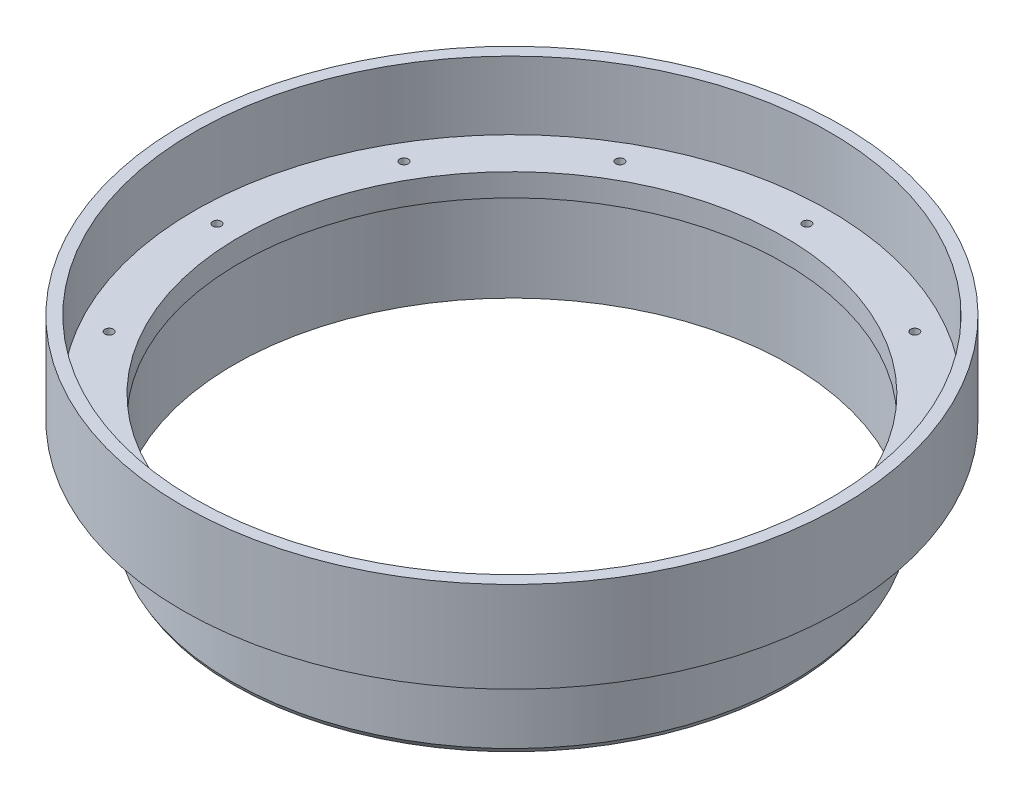
ISO-10303-21;
HEADER;
FILE_DESCRIPTION(('STEP AP214'),'2;1');
FILE_NAME('part.step','',(''),(''),'','','');
FILE_SCHEMA(('AUTOMOTIVE_DESIGN { 1 0 10303 214 1 1 1 1 }'));
ENDSEC;
DATA;
#1=APPLICATION_CONTEXT('core data for automotive mechanical design processes');
#2=APPLICATION_PROTOCOL_DEFINITION('international standard','automotive_design',2000,#1);
#3=PRODUCT_CONTEXT('',#1,'mechanical');
#4=PRODUCT('Part','Part','',(#3));
#5=PRODUCT_RELATED_PRODUCT_CATEGORY('part','',(#4));
#6=PRODUCT_DEFINITION_FORMATION('','',#4);
#7=PRODUCT_DEFINITION_CONTEXT('part definition',#1,'design');
#8=PRODUCT_DEFINITION('design','',#6,#7);
#9=PRODUCT_DEFINITION_SHAPE('','',#8);
#10=(LENGTH_UNIT() NAMED_UNIT(*) SI_UNIT(.MILLI.,.METRE.));
#11=(NAMED_UNIT(*) PLANE_ANGLE_UNIT() SI_UNIT($,.RADIAN.));
#12=(NAMED_UNIT(*) SI_UNIT($,.STERADIAN.) SOLID_ANGLE_UNIT());
#13=UNCERTAINTY_MEASURE_WITH_UNIT(LENGTH_MEASURE(1.E-05),#10,'distance_accuracy_value','');
#14=(GEOMETRIC_REPRESENTATION_CONTEXT(3) GLOBAL_UNCERTAINTY_ASSIGNED_CONTEXT((#13)) GLOBAL_UNIT_ASSIGNED_CONTEXT((#10,
#11,#12)) REPRESENTATION_CONTEXT('',''));
#15=CARTESIAN_POINT('',(0.,0.,0.));
#16=DIRECTION('',(0.,0.,1.));
#17=DIRECTION('',(1.,0.,0.));
#18=AXIS2_PLACEMENT_3D('',#15,#16,#17);
#19=CARTESIAN_POINT('',(-44.45,0.,0.));
#20=DIRECTION('',(0.,1.,0.));
#21=DIRECTION('',(0.,0.,1.));
#22=AXIS2_PLACEMENT_3D('',#19,#20,#21);
#23=PLANE('',#22);
#24=CARTESIAN_POINT('',(-35.7451985412029,0.,20.6374999999996));
#25=DIRECTION('',(0.,1.,0.));
#26=DIRECTION('',(0.,0.,1.));
#27=AXIS2_PLACEMENT_3D('',#24,#25,#26);
#28=CIRCLE('',#27,0.59563);
#29=CARTESIAN_POINT('',(-35.7451985412029,0.,21.2331299999996));
#30=VERTEX_POINT('',#29);
#31=EDGE_CURVE('E140',#30,#30,#28,.T.);
#32=ORIENTED_EDGE('',*,*,#31,.F.);
#33=EDGE_LOOP('',(#32));
#34=FACE_BOUND('',#33,.T.);
#35=CARTESIAN_POINT('',(-20.6375000000004,0.,35.7451985412025));
#36=DIRECTION('',(0.,1.,0.));
#37=DIRECTION('',(0.,0.,1.));
#38=AXIS2_PLACEMENT_3D('',#35,#36,#37);
#39=CIRCLE('',#38,0.59563);
#40=CARTESIAN_POINT('',(-20.6375000000004,0.,36.3408285412025));
#41=VERTEX_POINT('',#40);
#42=EDGE_CURVE('E134',#41,#41,#39,.T.);
#43=ORIENTED_EDGE('',*,*,#42,.F.);
#44=EDGE_LOOP('',(#43));
#45=FACE_BOUND('',#44,.T.);
#46=CARTESIAN_POINT('',(-3.53958818572525E-13,0.,41.275));
#47=DIRECTION('',(0.,1.,0.));
#48=DIRECTION('',(0.,0.,1.));
#49=AXIS2_PLACEMENT_3D('',#46,#47,#48);
#50=CIRCLE('',#49,0.595629999999999);
#51=CARTESIAN_POINT('',(-3.53958818572525E-13,0.,41.87063));
#52=VERTEX_POINT('',#51);
#53=EDGE_CURVE('E128',#52,#52,#50,.T.);
#54=ORIENTED_EDGE('',*,*,#53,.F.);
#55=EDGE_LOOP('',(#54));
#56=FACE_BOUND('',#55,.T.);
#57=CARTESIAN_POINT('',(20.6374999999997,0.,35.7451985412029));
#58=DIRECTION('',(0.,1.,0.));
#59=DIRECTION('',(0.,0.,1.));
#60=AXIS2_PLACEMENT_3D('',#57,#58,#59);
#61=CIRCLE('',#60,0.59563);
#62=CARTESIAN_POINT('',(20.6374999999997,0.,36.3408285412029));
#63=VERTEX_POINT('',#62);
#64=EDGE_CURVE('E122',#63,#63,#61,.T.);
#65=ORIENTED_EDGE('',*,*,#64,.F.);
#66=EDGE_LOOP('',(#65));
#67=FACE_BOUND('',#66,.T.);
#68=CARTESIAN_POINT('',(35.7451985412026,0.,20.6375000000002));
#69=DIRECTION('',(0.,1.,0.));
#70=DIRECTION('',(0.,0.,1.));
#71=AXIS2_PLACEMENT_3D('',#68,#69,#70);
#72=CIRCLE('',#71,0.59563);
#73=CARTESIAN_POINT('',(35.7451985412026,0.,21.2331300000002));
#74=VERTEX_POINT('',#73);
#75=EDGE_CURVE('E116',#74,#74,#72,.T.);
#76=ORIENTED_EDGE('',*,*,#75,.F.);
#77=EDGE_LOOP('',(#76));
#78=FACE_BOUND('',#77,.T.);
#79=CARTESIAN_POINT('',(41.275,0.,2.28177708448336E-13));
#80=DIRECTION('',(0.,1.,0.));
#81=DIRECTION('',(0.,0.,1.));
#82=AXIS2_PLACEMENT_3D('',#79,#80,#81);
#83=CIRCLE('',#82,0.59563);
#84=CARTESIAN_POINT('',(41.275,0.,0.595630000000228));
#85=VERTEX_POINT('',#84);
#86=EDGE_CURVE('E110',#85,#85,#83,.T.);
#87=ORIENTED_EDGE('',*,*,#86,.F.);
#88=EDGE_LOOP('',(#87));
#89=FACE_BOUND('',#88,.T.);
#90=CARTESIAN_POINT('',(35.7451985412028,0.,-20.6374999999998));
#91=DIRECTION('',(0.,1.,0.));
#92=DIRECTION('',(0.,0.,1.));
#93=AXIS2_PLACEMENT_3D('',#90,#91,#92);
#94=CIRCLE('',#93,0.59563);
#95=CARTESIAN_POINT('',(35.7451985412028,0.,-20.0418699999998));
#96=VERTEX_POINT('',#95);
#97=EDGE_CURVE('E104',#96,#96,#94,.T.);
#98=ORIENTED_EDGE('',*,*,#97,.F.);
#99=EDGE_LOOP('',(#98));
#100=FACE_BOUND('',#99,.T.);
#101=CARTESIAN_POINT('',(20.6375000000001,0.,-35.7451985412026));
#102=DIRECTION('',(0.,1.,0.));
#103=DIRECTION('',(0.,0.,1.));
#104=AXIS2_PLACEMENT_3D('',#101,#102,#103);
#105=CIRCLE('',#104,0.59563);
#106=CARTESIAN_POINT('',(20.6375000000001,0.,-35.1495685412026));
#107=VERTEX_POINT('',#106);
#108=EDGE_CURVE('E98',#107,#107,#105,.T.);
#109=ORIENTED_EDGE('',*,*,#108,.F.);
#110=EDGE_LOOP('',(#109));
#111=FACE_BOUND('',#110,.T.);
#112=CARTESIAN_POINT('',(1.11561489392428E-13,0.,-41.275));
#113=DIRECTION('',(0.,1.,0.));
#114=DIRECTION('',(0.,0.,1.));
#115=AXIS2_PLACEMENT_3D('',#112,#113,#114);
#116=CIRCLE('',#115,0.595629999999999);
#117=CARTESIAN_POINT('',(1.11561489392428E-13,0.,-40.67937));
#118=VERTEX_POINT('',#117);
#119=EDGE_CURVE('E92',#118,#118,#116,.T.);
#120=ORIENTED_EDGE('',*,*,#119,.F.);
#121=EDGE_LOOP('',(#120));
#122=FACE_BOUND('',#121,.T.);
#123=CARTESIAN_POINT('',(-20.6374999999999,0.,-35.7451985412027));
#124=DIRECTION('',(0.,1.,0.));
#125=DIRECTION('',(0.,0.,1.));
#126=AXIS2_PLACEMENT_3D('',#123,#124,#125);
#127=CIRCLE('',#126,0.59563);
#128=CARTESIAN_POINT('',(-20.6374999999999,0.,-35.1495685412027));
#129=VERTEX_POINT('',#128);
#130=EDGE_CURVE('E86',#129,#129,#127,.T.);
#131=ORIENTED_EDGE('',*,*,#130,.F.);
#132=EDGE_LOOP('',(#131));
#133=FACE_BOUND('',#132,.T.);
#134=CARTESIAN_POINT('',(-35.7451985412027,0.,-20.6375));
#135=DIRECTION('',(0.,1.,0.));
#136=DIRECTION('',(0.,0.,1.));
#137=AXIS2_PLACEMENT_3D('',#134,#135,#136);
#138=CIRCLE('',#137,0.59563);
#139=CARTESIAN_POINT('',(-35.7451985412027,0.,-20.04187));
#140=VERTEX_POINT('',#139);
#141=EDGE_CURVE('E80',#140,#140,#138,.T.);
#142=ORIENTED_EDGE('',*,*,#141,.F.);
#143=EDGE_LOOP('',(#142));
#144=FACE_BOUND('',#143,.T.);
#145=CARTESIAN_POINT('',(-41.275,0.,0.));
#146=DIRECTION('',(0.,1.,0.));
#147=DIRECTION('',(0.,0.,1.));
#148=AXIS2_PLACEMENT_3D('',#145,#146,#147);
#149=CIRCLE('',#148,0.59563);
#150=CARTESIAN_POINT('',(-41.275,0.,0.595630000000005));
#151=VERTEX_POINT('',#150);
#152=EDGE_CURVE('E74',#151,#151,#149,.T.);
#153=ORIENTED_EDGE('',*,*,#152,.F.);
#154=EDGE_LOOP('',(#153));
#155=FACE_BOUND('',#154,.T.);
#156=CARTESIAN_POINT('',(0.,0.,0.));
#157=DIRECTION('',(0.,1.,0.));
#158=DIRECTION('',(0.,0.,1.));
#159=AXIS2_PLACEMENT_3D('',#156,#157,#158);
#160=CIRCLE('',#159,44.45);
#161=CARTESIAN_POINT('',(0.,0.,44.45));
#162=VERTEX_POINT('',#161);
#163=EDGE_CURVE('E68',#162,#162,#160,.T.);
#164=ORIENTED_EDGE('',*,*,#163,.T.);
#165=EDGE_LOOP('',(#164));
#166=FACE_BOUND('',#165,.T.);
#167=CARTESIAN_POINT('',(0.,0.,0.));
#168=DIRECTION('',(0.,1.,0.));
#169=DIRECTION('',(0.,0.,1.));
#170=AXIS2_PLACEMENT_3D('',#167,#168,#169);
#171=CIRCLE('',#170,38.1);
#172=CARTESIAN_POINT('',(0.,0.,38.1));
#173=VERTEX_POINT('',#172);
#174=EDGE_CURVE('E10',#173,#173,#171,.T.);
#175=ORIENTED_EDGE('',*,*,#174,.F.);
#176=EDGE_LOOP('',(#175));
#177=FACE_BOUND('',#176,.T.);
#178=ADVANCED_FACE('F34',(#34,#45,#56,#67,#78,#89,#100,#111,#122,#133,#144,#155,#166,#177),#23,.T.);
#179=CARTESIAN_POINT('',(0.,55.,0.));
#180=DIRECTION('',(0.,1.,0.));
#181=DIRECTION('',(0.,0.,1.));
#182=AXIS2_PLACEMENT_3D('',#179,#180,#181);
#183=CYLINDRICAL_SURFACE('',#182,38.1);
#184=ORIENTED_EDGE('',*,*,#174,.T.);
#185=EDGE_LOOP('',(#184));
#186=FACE_BOUND('',#185,.T.);
#187=CARTESIAN_POINT('',(0.,-3.175,0.));
#188=DIRECTION('',(0.,1.,0.));
#189=DIRECTION('',(0.,0.,1.));
#190=AXIS2_PLACEMENT_3D('',#187,#188,#189);
#191=CIRCLE('',#190,38.1);
#192=CARTESIAN_POINT('',(0.,-3.175,38.1));
#193=VERTEX_POINT('',#192);
#194=EDGE_CURVE('E40',#193,#193,#191,.T.);
#195=ORIENTED_EDGE('',*,*,#194,.F.);
#196=EDGE_LOOP('',(#195));
#197=FACE_BOUND('',#196,.T.);
#198=ADVANCED_FACE('F148',(#186,#197),#183,.F.);
#199=CARTESIAN_POINT('',(-38.1,-3.175,0.));
#200=DIRECTION('',(0.,-1.,0.));
#201=DIRECTION('',(0.,0.,-1.));
#202=AXIS2_PLACEMENT_3D('',#199,#200,#201);
#203=PLANE('',#202);
#204=ORIENTED_EDGE('',*,*,#194,.T.);
#205=EDGE_LOOP('',(#204));
#206=FACE_BOUND('',#205,.T.);
#207=CARTESIAN_POINT('',(0.,-3.175,0.));
#208=DIRECTION('',(0.,1.,0.));
#209=DIRECTION('',(0.,0.,1.));
#210=AXIS2_PLACEMENT_3D('',#207,#208,#209);
#211=CIRCLE('',#210,38.8874);
#212=CARTESIAN_POINT('',(0.,-3.175,38.8874));
#213=VERTEX_POINT('',#212);
#214=EDGE_CURVE('E44',#213,#213,#211,.T.);
#215=ORIENTED_EDGE('',*,*,#214,.F.);
#216=EDGE_LOOP('',(#215));
#217=FACE_BOUND('',#216,.T.);
#218=ADVANCED_FACE('F210',(#206,#217),#203,.T.);
#219=CARTESIAN_POINT('',(0.,55.,0.));
#220=DIRECTION('',(0.,1.,0.));
#221=DIRECTION('',(0.,0.,1.));
#222=AXIS2_PLACEMENT_3D('',#219,#220,#221);
#223=CYLINDRICAL_SURFACE('',#222,38.8874);
#224=ORIENTED_EDGE('',*,*,#214,.T.);
#225=EDGE_LOOP('',(#224));
#226=FACE_BOUND('',#225,.T.);
#227=CARTESIAN_POINT('',(0.,-15.875,0.));
#228=DIRECTION('',(0.,1.,0.));
#229=DIRECTION('',(0.,0.,1.));
#230=AXIS2_PLACEMENT_3D('',#227,#228,#229);
#231=CIRCLE('',#230,38.8874);
#232=CARTESIAN_POINT('',(0.,-15.875,38.8874));
#233=VERTEX_POINT('',#232);
#234=EDGE_CURVE('E48',#233,#233,#231,.T.);
#235=ORIENTED_EDGE('',*,*,#234,.F.);
#236=EDGE_LOOP('',(#235));
#237=FACE_BOUND('',#236,.T.);
#238=ADVANCED_FACE('F206',(#226,#237),#223,.F.);
#239=CARTESIAN_POINT('',(0.,-15.2150886423163,0.));
#240=DIRECTION('',(0.,1.,0.));
#241=DIRECTION('',(0.,0.,1.));
#242=AXIS2_PLACEMENT_3D('',#239,#240,#241);
#243=CONICAL_SURFACE('',#242,39.2684,0.523598775598298);
#244=ORIENTED_EDGE('',*,*,#234,.T.);
#245=EDGE_LOOP('',(#244));
#246=FACE_BOUND('',#245,.T.);
#247=CARTESIAN_POINT('',(0.,-15.2150886423163,0.));
#248=DIRECTION('',(0.,1.,0.));
#249=DIRECTION('',(0.,0.,1.));
#250=AXIS2_PLACEMENT_3D('',#247,#248,#249);
#251=CIRCLE('',#250,39.2684);
#252=CARTESIAN_POINT('',(0.,-15.2150886423163,39.2684));
#253=VERTEX_POINT('',#252);
#254=EDGE_CURVE('E53',#253,#253,#251,.T.);
#255=ORIENTED_EDGE('',*,*,#254,.F.);
#256=EDGE_LOOP('',(#255));
#257=FACE_BOUND('',#256,.T.);
#258=ADVANCED_FACE('F202',(#246,#257),#243,.T.);
#259=CARTESIAN_POINT('',(0.,55.,0.));
#260=DIRECTION('',(0.,1.,0.));
#261=DIRECTION('',(0.,0.,1.));
#262=AXIS2_PLACEMENT_3D('',#259,#260,#261);
#263=CYLINDRICAL_SURFACE('',#262,39.2684);
#264=ORIENTED_EDGE('',*,*,#254,.T.);
#265=EDGE_LOOP('',(#264));
#266=FACE_BOUND('',#265,.T.);
#267=CARTESIAN_POINT('',(0.,-3.175,0.));
#268=DIRECTION('',(0.,1.,0.));
#269=DIRECTION('',(0.,0.,1.));
#270=AXIS2_PLACEMENT_3D('',#267,#268,#269);
#271=CIRCLE('',#270,39.2684);
#272=CARTESIAN_POINT('',(0.,-3.175,39.2684));
#273=VERTEX_POINT('',#272);
#274=EDGE_CURVE('E56',#273,#273,#271,.T.);
#275=ORIENTED_EDGE('',*,*,#274,.F.);
#276=EDGE_LOOP('',(#275));
#277=FACE_BOUND('',#276,.T.);
#278=ADVANCED_FACE('F198',(#266,#277),#263,.T.);
#279=CARTESIAN_POINT('',(-39.2684,-3.175,0.));
#280=DIRECTION('',(0.,-1.,0.));
#281=DIRECTION('',(0.,0.,-1.));
#282=AXIS2_PLACEMENT_3D('',#279,#280,#281);
#283=PLANE('',#282);
#284=CARTESIAN_POINT('',(-35.7451985412029,-3.175,20.6374999999996));
#285=DIRECTION('',(0.,1.,0.));
#286=DIRECTION('',(0.,0.,1.));
#287=AXIS2_PLACEMENT_3D('',#284,#285,#286);
#288=CIRCLE('',#287,0.59563);
#289=CARTESIAN_POINT('',(-35.7451985412029,-3.175,21.2331299999996));
#290=VERTEX_POINT('',#289);
#291=EDGE_CURVE('E137',#290,#290,#288,.T.);
#292=ORIENTED_EDGE('',*,*,#291,.T.);
#293=EDGE_LOOP('',(#292));
#294=FACE_BOUND('',#293,.T.);
#295=CARTESIAN_POINT('',(-20.6375000000004,-3.175,35.7451985412025));
#296=DIRECTION('',(0.,1.,0.));
#297=DIRECTION('',(0.,0.,1.));
#298=AXIS2_PLACEMENT_3D('',#295,#296,#297);
#299=CIRCLE('',#298,0.59563);
#300=CARTESIAN_POINT('',(-20.6375000000004,-3.175,36.3408285412025));
#301=VERTEX_POINT('',#300);
#302=EDGE_CURVE('E131',#301,#301,#299,.T.);
#303=ORIENTED_EDGE('',*,*,#302,.T.);
#304=EDGE_LOOP('',(#303));
#305=FACE_BOUND('',#304,.T.);
#306=CARTESIAN_POINT('',(-3.53958818572525E-13,-3.175,41.275));
#307=DIRECTION('',(0.,1.,0.));
#308=DIRECTION('',(0.,0.,1.));
#309=AXIS2_PLACEMENT_3D('',#306,#307,#308);
#310=CIRCLE('',#309,0.595629999999999);
#311=CARTESIAN_POINT('',(-3.53958818572525E-13,-3.175,41.87063));
#312=VERTEX_POINT('',#311);
#313=EDGE_CURVE('E125',#312,#312,#310,.T.);
#314=ORIENTED_EDGE('',*,*,#313,.T.);
#315=EDGE_LOOP('',(#314));
#316=FACE_BOUND('',#315,.T.);
#317=CARTESIAN_POINT('',(20.6374999999997,-3.175,35.7451985412029));
#318=DIRECTION('',(0.,1.,0.));
#319=DIRECTION('',(0.,0.,1.));
#320=AXIS2_PLACEMENT_3D('',#317,#318,#319);
#321=CIRCLE('',#320,0.59563);
#322=CARTESIAN_POINT('',(20.6374999999997,-3.175,36.3408285412029));
#323=VERTEX_POINT('',#322);
#324=EDGE_CURVE('E119',#323,#323,#321,.T.);
#325=ORIENTED_EDGE('',*,*,#324,.T.);
#326=EDGE_LOOP('',(#325));
#327=FACE_BOUND('',#326,.T.);
#328=CARTESIAN_POINT('',(35.7451985412026,-3.175,20.6375000000002));
#329=DIRECTION('',(0.,1.,0.));
#330=DIRECTION('',(0.,0.,1.));
#331=AXIS2_PLACEMENT_3D('',#328,#329,#330);
#332=CIRCLE('',#331,0.59563);
#333=CARTESIAN_POINT('',(35.7451985412026,-3.175,21.2331300000002));
#334=VERTEX_POINT('',#333);
#335=EDGE_CURVE('E113',#334,#334,#332,.T.);
#336=ORIENTED_EDGE('',*,*,#335,.T.);
#337=EDGE_LOOP('',(#336));
#338=FACE_BOUND('',#337,.T.);
#339=CARTESIAN_POINT('',(41.275,-3.175,2.28177708448336E-13));
#340=DIRECTION('',(0.,1.,0.));
#341=DIRECTION('',(0.,0.,1.));
#342=AXIS2_PLACEMENT_3D('',#339,#340,#341);
#343=CIRCLE('',#342,0.59563);
#344=CARTESIAN_POINT('',(41.275,-3.175,0.595630000000228));
#345=VERTEX_POINT('',#344);
#346=EDGE_CURVE('E107',#345,#345,#343,.T.);
#347=ORIENTED_EDGE('',*,*,#346,.T.);
#348=EDGE_LOOP('',(#347));
#349=FACE_BOUND('',#348,.T.);
#350=CARTESIAN_POINT('',(35.7451985412028,-3.175,-20.6374999999998));
#351=DIRECTION('',(0.,1.,0.));
#352=DIRECTION('',(0.,0.,1.));
#353=AXIS2_PLACEMENT_3D('',#350,#351,#352);
#354=CIRCLE('',#353,0.59563);
#355=CARTESIAN_POINT('',(35.7451985412028,-3.175,-20.0418699999998));
#356=VERTEX_POINT('',#355);
#357=EDGE_CURVE('E101',#356,#356,#354,.T.);
#358=ORIENTED_EDGE('',*,*,#357,.T.);
#359=EDGE_LOOP('',(#358));
#360=FACE_BOUND('',#359,.T.);
#361=CARTESIAN_POINT('',(20.6375000000001,-3.175,-35.7451985412026));
#362=DIRECTION('',(0.,1.,0.));
#363=DIRECTION('',(0.,0.,1.));
#364=AXIS2_PLACEMENT_3D('',#361,#362,#363);
#365=CIRCLE('',#364,0.59563);
#366=CARTESIAN_POINT('',(20.6375000000001,-3.175,-35.1495685412026));
#367=VERTEX_POINT('',#366);
#368=EDGE_CURVE('E95',#367,#367,#365,.T.);
#369=ORIENTED_EDGE('',*,*,#368,.T.);
#370=EDGE_LOOP('',(#369));
#371=FACE_BOUND('',#370,.T.);
#372=CARTESIAN_POINT('',(1.11561489392428E-13,-3.175,-41.275));
#373=DIRECTION('',(0.,1.,0.));
#374=DIRECTION('',(0.,0.,1.));
#375=AXIS2_PLACEMENT_3D('',#372,#373,#374);
#376=CIRCLE('',#375,0.595629999999999);
#377=CARTESIAN_POINT('',(1.11561489392428E-13,-3.175,-40.67937));
#378=VERTEX_POINT('',#377);
#379=EDGE_CURVE('E89',#378,#378,#376,.T.);
#380=ORIENTED_EDGE('',*,*,#379,.T.);
#381=EDGE_LOOP('',(#380));
#382=FACE_BOUND('',#381,.T.);
#383=CARTESIAN_POINT('',(-20.6374999999999,-3.175,-35.7451985412027));
#384=DIRECTION('',(0.,1.,0.));
#385=DIRECTION('',(0.,0.,1.));
#386=AXIS2_PLACEMENT_3D('',#383,#384,#385);
#387=CIRCLE('',#386,0.59563);
#388=CARTESIAN_POINT('',(-20.6374999999999,-3.175,-35.1495685412027));
#389=VERTEX_POINT('',#388);
#390=EDGE_CURVE('E83',#389,#389,#387,.T.);
#391=ORIENTED_EDGE('',*,*,#390,.T.);
#392=EDGE_LOOP('',(#391));
#393=FACE_BOUND('',#392,.T.);
#394=CARTESIAN_POINT('',(-35.7451985412027,-3.175,-20.6375));
#395=DIRECTION('',(0.,1.,0.));
#396=DIRECTION('',(0.,0.,1.));
#397=AXIS2_PLACEMENT_3D('',#394,#395,#396);
#398=CIRCLE('',#397,0.59563);
#399=CARTESIAN_POINT('',(-35.7451985412027,-3.175,-20.04187));
#400=VERTEX_POINT('',#399);
#401=EDGE_CURVE('E77',#400,#400,#398,.T.);
#402=ORIENTED_EDGE('',*,*,#401,.T.);
#403=EDGE_LOOP('',(#402));
#404=FACE_BOUND('',#403,.T.);
#405=CARTESIAN_POINT('',(-41.275,-3.175,0.));
#406=DIRECTION('',(0.,1.,0.));
#407=DIRECTION('',(0.,0.,1.));
#408=AXIS2_PLACEMENT_3D('',#405,#406,#407);
#409=CIRCLE('',#408,0.59563);
#410=CARTESIAN_POINT('',(-41.275,-3.175,0.595630000000005));
#411=VERTEX_POINT('',#410);
#412=EDGE_CURVE('E71',#411,#411,#409,.T.);
#413=ORIENTED_EDGE('',*,*,#412,.T.);
#414=EDGE_LOOP('',(#413));
#415=FACE_BOUND('',#414,.T.);
#416=ORIENTED_EDGE('',*,*,#274,.T.);
#417=EDGE_LOOP('',(#416));
#418=FACE_BOUND('',#417,.T.);
#419=CARTESIAN_POINT('',(0.,-3.175,0.));
#420=DIRECTION('',(0.,1.,0.));
#421=DIRECTION('',(0.,0.,1.));
#422=AXIS2_PLACEMENT_3D('',#419,#420,#421);
#423=CIRCLE('',#422,46.1264);
#424=CARTESIAN_POINT('',(0.,-3.175,46.1264));
#425=VERTEX_POINT('',#424);
#426=EDGE_CURVE('E59',#425,#425,#423,.T.);
#427=ORIENTED_EDGE('',*,*,#426,.F.);
#428=EDGE_LOOP('',(#427));
#429=FACE_BOUND('',#428,.T.);
#430=ADVANCED_FACE('F194',(#294,#305,#316,#327,#338,#349,#360,#371,#382,#393,#404,#415,#418,
#429),#283,.T.);
#431=CARTESIAN_POINT('',(0.,55.,0.));
#432=DIRECTION('',(0.,1.,0.));
#433=DIRECTION('',(0.,0.,1.));
#434=AXIS2_PLACEMENT_3D('',#431,#432,#433);
#435=CYLINDRICAL_SURFACE('',#434,46.1264);
#436=ORIENTED_EDGE('',*,*,#426,.T.);
#437=EDGE_LOOP('',(#436));
#438=FACE_BOUND('',#437,.T.);
#439=CARTESIAN_POINT('',(0.,9.525,0.));
#440=DIRECTION('',(0.,1.,0.));
#441=DIRECTION('',(0.,0.,1.));
#442=AXIS2_PLACEMENT_3D('',#439,#440,#441);
#443=CIRCLE('',#442,46.1264);
#444=CARTESIAN_POINT('',(0.,9.525,46.1264));
#445=VERTEX_POINT('',#444);
#446=EDGE_CURVE('E62',#445,#445,#443,.T.);
#447=ORIENTED_EDGE('',*,*,#446,.F.);
#448=EDGE_LOOP('',(#447));
#449=FACE_BOUND('',#448,.T.);
#450=ADVANCED_FACE('F187',(#438,#449),#435,.T.);
#451=CARTESIAN_POINT('',(-46.1264,9.525,0.));
#452=DIRECTION('',(0.,1.,0.));
#453=DIRECTION('',(0.,0.,1.));
#454=AXIS2_PLACEMENT_3D('',#451,#452,#453);
#455=PLANE('',#454);
#456=ORIENTED_EDGE('',*,*,#446,.T.);
#457=EDGE_LOOP('',(#456));
#458=FACE_BOUND('',#457,.T.);
#459=CARTESIAN_POINT('',(0.,9.525,0.));
#460=DIRECTION('',(0.,1.,0.));
#461=DIRECTION('',(0.,0.,1.));
#462=AXIS2_PLACEMENT_3D('',#459,#460,#461);
#463=CIRCLE('',#462,44.45);
#464=CARTESIAN_POINT('',(0.,9.525,44.45));
#465=VERTEX_POINT('',#464);
#466=EDGE_CURVE('E65',#465,#465,#463,.T.);
#467=ORIENTED_EDGE('',*,*,#466,.F.);
#468=EDGE_LOOP('',(#467));
#469=FACE_BOUND('',#468,.T.);
#470=ADVANCED_FACE('F177',(#458,#469),#455,.T.);
#471=CARTESIAN_POINT('',(0.,55.,0.));
#472=DIRECTION('',(0.,1.,0.));
#473=DIRECTION('',(0.,0.,1.));
#474=AXIS2_PLACEMENT_3D('',#471,#472,#473);
#475=CYLINDRICAL_SURFACE('',#474,44.45);
#476=ORIENTED_EDGE('',*,*,#466,.T.);
#477=EDGE_LOOP('',(#476));
#478=FACE_BOUND('',#477,.T.);
#479=ORIENTED_EDGE('',*,*,#163,.F.);
#480=EDGE_LOOP('',(#479));
#481=FACE_BOUND('',#480,.T.);
#482=ADVANCED_FACE('F174',(#478,#481),#475,.F.);
#483=CARTESIAN_POINT('',(-41.275,0.,0.));
#484=DIRECTION('',(0.,1.,0.));
#485=DIRECTION('',(0.,0.,1.));
#486=AXIS2_PLACEMENT_3D('',#483,#484,#485);
#487=CYLINDRICAL_SURFACE('',#486,0.59563);
#488=ORIENTED_EDGE('',*,*,#412,.F.);
#489=EDGE_LOOP('',(#488));
#490=FACE_BOUND('',#489,.T.);
#491=ORIENTED_EDGE('',*,*,#152,.T.);
#492=EDGE_LOOP('',(#491));
#493=FACE_BOUND('',#492,.T.);
#494=ADVANCED_FACE('F176',(#490,#493),#487,.F.);
#495=CARTESIAN_POINT('',(-35.7451985412027,0.,-20.6375));
#496=DIRECTION('',(0.,1.,0.));
#497=DIRECTION('',(0.,0.,1.));
#498=AXIS2_PLACEMENT_3D('',#495,#496,#497);
#499=CYLINDRICAL_SURFACE('',#498,0.59563);
#500=ORIENTED_EDGE('',*,*,#401,.F.);
#501=EDGE_LOOP('',(#500));
#502=FACE_BOUND('',#501,.T.);
#503=ORIENTED_EDGE('',*,*,#141,.T.);
#504=EDGE_LOOP('',(#503));
#505=FACE_BOUND('',#504,.T.);
#506=ADVANCED_FACE('F184',(#502,#505),#499,.F.);
#507=CARTESIAN_POINT('',(-20.6374999999999,0.,-35.7451985412027));
#508=DIRECTION('',(0.,1.,0.));
#509=DIRECTION('',(0.,0.,1.));
#510=AXIS2_PLACEMENT_3D('',#507,#508,#509);
#511=CYLINDRICAL_SURFACE('',#510,0.59563);
#512=ORIENTED_EDGE('',*,*,#390,.F.);
#513=EDGE_LOOP('',(#512));
#514=FACE_BOUND('',#513,.T.);
#515=ORIENTED_EDGE('',*,*,#130,.T.);
#516=EDGE_LOOP('',(#515));
#517=FACE_BOUND('',#516,.T.);
#518=ADVANCED_FACE('F307',(#514,#517),#511,.F.);
#519=CARTESIAN_POINT('',(1.11561489392428E-13,0.,-41.275));
#520=DIRECTION('',(0.,1.,0.));
#521=DIRECTION('',(0.,0.,1.));
#522=AXIS2_PLACEMENT_3D('',#519,#520,#521);
#523=CYLINDRICAL_SURFACE('',#522,0.595629999999999);
#524=ORIENTED_EDGE('',*,*,#379,.F.);
#525=EDGE_LOOP('',(#524));
#526=FACE_BOUND('',#525,.T.);
#527=ORIENTED_EDGE('',*,*,#119,.T.);
#528=EDGE_LOOP('',(#527));
#529=FACE_BOUND('',#528,.T.);
#530=ADVANCED_FACE('F301',(#526,#529),#523,.F.);
#531=CARTESIAN_POINT('',(20.6375000000001,0.,-35.7451985412026));
#532=DIRECTION('',(0.,1.,0.));
#533=DIRECTION('',(0.,0.,1.));
#534=AXIS2_PLACEMENT_3D('',#531,#532,#533);
#535=CYLINDRICAL_SURFACE('',#534,0.59563);
#536=ORIENTED_EDGE('',*,*,#368,.F.);
#537=EDGE_LOOP('',(#536));
#538=FACE_BOUND('',#537,.T.);
#539=ORIENTED_EDGE('',*,*,#108,.T.);
#540=EDGE_LOOP('',(#539));
#541=FACE_BOUND('',#540,.T.);
#542=ADVANCED_FACE('F306',(#538,#541),#535,.F.);
#543=CARTESIAN_POINT('',(35.7451985412028,0.,-20.6374999999998));
#544=DIRECTION('',(0.,1.,0.));
#545=DIRECTION('',(0.,0.,1.));
#546=AXIS2_PLACEMENT_3D('',#543,#544,#545);
#547=CYLINDRICAL_SURFACE('',#546,0.59563);
#548=ORIENTED_EDGE('',*,*,#357,.F.);
#549=EDGE_LOOP('',(#548));
#550=FACE_BOUND('',#549,.T.);
#551=ORIENTED_EDGE('',*,*,#97,.T.);
#552=EDGE_LOOP('',(#551));
#553=FACE_BOUND('',#552,.T.);
#554=ADVANCED_FACE('F291',(#550,#553),#547,.F.);
#555=CARTESIAN_POINT('',(41.275,0.,2.28177708448336E-13));
#556=DIRECTION('',(0.,1.,0.));
#557=DIRECTION('',(0.,0.,1.));
#558=AXIS2_PLACEMENT_3D('',#555,#556,#557);
#559=CYLINDRICAL_SURFACE('',#558,0.59563);
#560=ORIENTED_EDGE('',*,*,#346,.F.);
#561=EDGE_LOOP('',(#560));
#562=FACE_BOUND('',#561,.T.);
#563=ORIENTED_EDGE('',*,*,#86,.T.);
#564=EDGE_LOOP('',(#563));
#565=FACE_BOUND('',#564,.T.);
#566=ADVANCED_FACE('F285',(#562,#565),#559,.F.);
#567=CARTESIAN_POINT('',(35.7451985412026,0.,20.6375000000002));
#568=DIRECTION('',(0.,1.,0.));
#569=DIRECTION('',(0.,0.,1.));
#570=AXIS2_PLACEMENT_3D('',#567,#568,#569);
#571=CYLINDRICAL_SURFACE('',#570,0.59563);
#572=ORIENTED_EDGE('',*,*,#335,.F.);
#573=EDGE_LOOP('',(#572));
#574=FACE_BOUND('',#573,.T.);
#575=ORIENTED_EDGE('',*,*,#75,.T.);
#576=EDGE_LOOP('',(#575));
#577=FACE_BOUND('',#576,.T.);
#578=ADVANCED_FACE('F290',(#574,#577),#571,.F.);
#579=CARTESIAN_POINT('',(20.6374999999997,0.,35.7451985412029));
#580=DIRECTION('',(0.,1.,0.));
#581=DIRECTION('',(0.,0.,1.));
#582=AXIS2_PLACEMENT_3D('',#579,#580,#581);
#583=CYLINDRICAL_SURFACE('',#582,0.59563);
#584=ORIENTED_EDGE('',*,*,#324,.F.);
#585=EDGE_LOOP('',(#584));
#586=FACE_BOUND('',#585,.T.);
#587=ORIENTED_EDGE('',*,*,#64,.T.);
#588=EDGE_LOOP('',(#587));
#589=FACE_BOUND('',#588,.T.);
#590=ADVANCED_FACE('F323',(#586,#589),#583,.F.);
#591=CARTESIAN_POINT('',(-3.53958818572525E-13,0.,41.275));
#592=DIRECTION('',(0.,1.,0.));
#593=DIRECTION('',(0.,0.,1.));
#594=AXIS2_PLACEMENT_3D('',#591,#592,#593);
#595=CYLINDRICAL_SURFACE('',#594,0.595629999999999);
#596=ORIENTED_EDGE('',*,*,#313,.F.);
#597=EDGE_LOOP('',(#596));
#598=FACE_BOUND('',#597,.T.);
#599=ORIENTED_EDGE('',*,*,#53,.T.);
#600=EDGE_LOOP('',(#599));
#601=FACE_BOUND('',#600,.T.);
#602=ADVANCED_FACE('F317',(#598,#601),#595,.F.);
#603=CARTESIAN_POINT('',(-20.6375000000004,0.,35.7451985412025));
#604=DIRECTION('',(0.,1.,0.));
#605=DIRECTION('',(0.,0.,1.));
#606=AXIS2_PLACEMENT_3D('',#603,#604,#605);
#607=CYLINDRICAL_SURFACE('',#606,0.59563);
#608=ORIENTED_EDGE('',*,*,#302,.F.);
#609=EDGE_LOOP('',(#608));
#610=FACE_BOUND('',#609,.T.);
#611=ORIENTED_EDGE('',*,*,#42,.T.);
#612=EDGE_LOOP('',(#611));
#613=FACE_BOUND('',#612,.T.);
#614=ADVANCED_FACE('F322',(#610,#613),#607,.F.);
#615=CARTESIAN_POINT('',(-35.7451985412029,0.,20.6374999999996));
#616=DIRECTION('',(0.,1.,0.));
#617=DIRECTION('',(0.,0.,1.));
#618=AXIS2_PLACEMENT_3D('',#615,#616,#617);
#619=CYLINDRICAL_SURFACE('',#618,0.59563);
#620=ORIENTED_EDGE('',*,*,#291,.F.);
#621=EDGE_LOOP('',(#620));
#622=FACE_BOUND('',#621,.T.);
#623=ORIENTED_EDGE('',*,*,#31,.T.);
#624=EDGE_LOOP('',(#623));
#625=FACE_BOUND('',#624,.T.);
#626=ADVANCED_FACE('F144',(#622,#625),#619,.F.);
#627=CLOSED_SHELL('',(#178,#198,#218,#238,#258,#278,#430,#450,#470,#482,#494,#506,#518,#530,
#542,#554,#566,#578,#590,#602,#614,#626));
#628=MANIFOLD_SOLID_BREP('B2',#627);
#629=ADVANCED_BREP_SHAPE_REPRESENTATION('',(#18,#628),#14);
#630=SHAPE_DEFINITION_REPRESENTATION(#9,#629);
ENDSEC;
END-ISO-10303-21;
